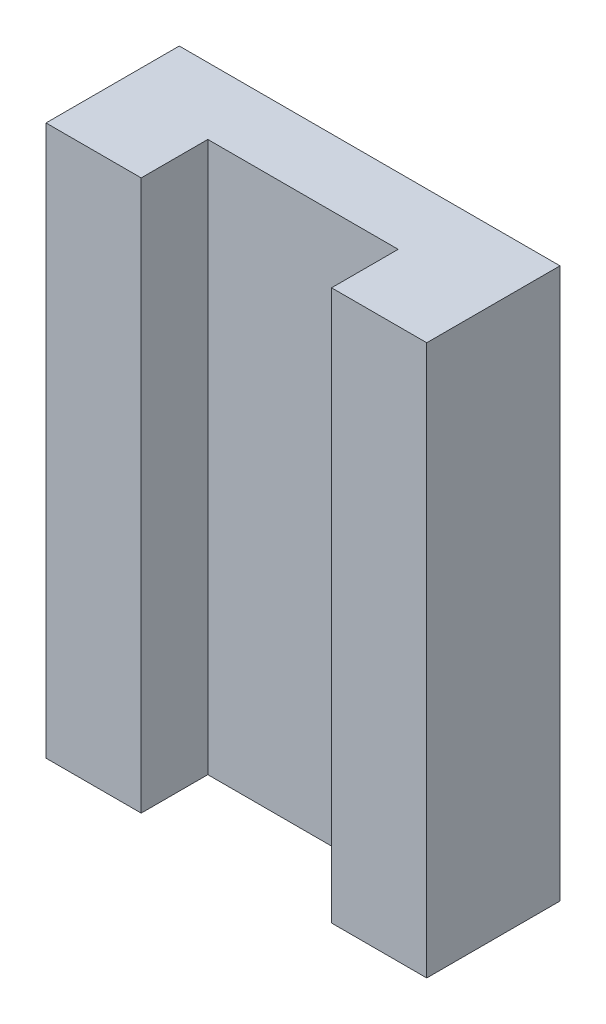
ISO-10303-21;
HEADER;
FILE_DESCRIPTION(('STEP AP214'),'2;1');
FILE_NAME('part.step','',(''),(''),'','','');
FILE_SCHEMA(('AUTOMOTIVE_DESIGN { 1 0 10303 214 1 1 1 1 }'));
ENDSEC;
DATA;
#1=APPLICATION_CONTEXT('core data for automotive mechanical design processes');
#2=APPLICATION_PROTOCOL_DEFINITION('international standard','automotive_design',2000,#1);
#3=PRODUCT_CONTEXT('',#1,'mechanical');
#4=PRODUCT('Part','Part','',(#3));
#5=PRODUCT_RELATED_PRODUCT_CATEGORY('part','',(#4));
#6=PRODUCT_DEFINITION_FORMATION('','',#4);
#7=PRODUCT_DEFINITION_CONTEXT('part definition',#1,'design');
#8=PRODUCT_DEFINITION('design','',#6,#7);
#9=PRODUCT_DEFINITION_SHAPE('','',#8);
#10=(LENGTH_UNIT() NAMED_UNIT(*) SI_UNIT(.MILLI.,.METRE.));
#11=(NAMED_UNIT(*) PLANE_ANGLE_UNIT() SI_UNIT($,.RADIAN.));
#12=(NAMED_UNIT(*) SI_UNIT($,.STERADIAN.) SOLID_ANGLE_UNIT());
#13=UNCERTAINTY_MEASURE_WITH_UNIT(LENGTH_MEASURE(1.E-05),#10,'distance_accuracy_value','');
#14=(GEOMETRIC_REPRESENTATION_CONTEXT(3) GLOBAL_UNCERTAINTY_ASSIGNED_CONTEXT((#13)) GLOBAL_UNIT_ASSIGNED_CONTEXT((#10,
#11,#12)) REPRESENTATION_CONTEXT('',''));
#15=CARTESIAN_POINT('',(0.,0.,0.));
#16=DIRECTION('',(0.,0.,1.));
#17=DIRECTION('',(1.,0.,0.));
#18=AXIS2_PLACEMENT_3D('',#15,#16,#17);
#19=CARTESIAN_POINT('',(0.,0.,7.));
#20=DIRECTION('',(0.,0.,-1.));
#21=DIRECTION('',(-1.,0.,0.));
#22=AXIS2_PLACEMENT_3D('',#19,#20,#21);
#23=PLANE('',#22);
#24=DIRECTION('',(1.,0.,0.));
#25=VECTOR('',#24,1.);
#26=CARTESIAN_POINT('',(-20.6864638809626,7.10354090893267,7.));
#27=LINE('',#26,#25);
#28=CARTESIAN_POINT('',(-40.6864638809626,7.10354090893267,7.));
#29=VERTEX_POINT('',#28);
#30=CARTESIAN_POINT('',(-35.6864638809626,7.10354090893267,7.));
#31=VERTEX_POINT('',#30);
#32=EDGE_CURVE('E88',#29,#31,#27,.T.);
#33=ORIENTED_EDGE('',*,*,#32,.T.);
#34=DIRECTION('',(0.,1.,0.));
#35=VECTOR('',#34,1.);
#36=CARTESIAN_POINT('',(-35.6864638809626,0.,7.));
#37=LINE('',#36,#35);
#38=CARTESIAN_POINT('',(-35.6864638809626,36.0035409089327,7.));
#39=VERTEX_POINT('',#38);
#40=EDGE_CURVE('E11',#31,#39,#37,.T.);
#41=ORIENTED_EDGE('',*,*,#40,.T.);
#42=DIRECTION('',(-1.,0.,0.));
#43=VECTOR('',#42,1.);
#44=CARTESIAN_POINT('',(-40.6864638809626,36.0035409089327,7.));
#45=LINE('',#44,#43);
#46=CARTESIAN_POINT('',(-40.6864638809626,36.0035409089327,7.));
#47=VERTEX_POINT('',#46);
#48=EDGE_CURVE('E58',#39,#47,#45,.T.);
#49=ORIENTED_EDGE('',*,*,#48,.T.);
#50=DIRECTION('',(0.,-1.,0.));
#51=VECTOR('',#50,1.);
#52=CARTESIAN_POINT('',(-40.6864638809626,7.10354090893267,7.));
#53=LINE('',#52,#51);
#54=EDGE_CURVE('E145',#47,#29,#53,.T.);
#55=ORIENTED_EDGE('',*,*,#54,.T.);
#56=EDGE_LOOP('',(#33,#41,#49,#55));
#57=FACE_BOUND('',#56,.T.);
#58=ADVANCED_FACE('F35',(#57),#23,.F.);
#59=CARTESIAN_POINT('',(-40.6864638809626,7.10354090893267,7.));
#60=DIRECTION('',(1.,0.,0.));
#61=DIRECTION('',(0.,0.,-1.));
#62=AXIS2_PLACEMENT_3D('',#59,#60,#61);
#63=PLANE('',#62);
#64=DIRECTION('',(0.,-1.,0.));
#65=VECTOR('',#64,1.);
#66=CARTESIAN_POINT('',(-40.6864638809626,7.10354090893267,0.));
#67=LINE('',#66,#65);
#68=CARTESIAN_POINT('',(-40.6864638809626,36.0035409089327,0.));
#69=VERTEX_POINT('',#68);
#70=CARTESIAN_POINT('',(-40.6864638809626,7.10354090893267,0.));
#71=VERTEX_POINT('',#70);
#72=EDGE_CURVE('E137',#69,#71,#67,.T.);
#73=ORIENTED_EDGE('',*,*,#72,.T.);
#74=DIRECTION('',(0.,0.,-1.));
#75=VECTOR('',#74,1.);
#76=CARTESIAN_POINT('',(-40.6864638809626,7.10354090893267,7.));
#77=LINE('',#76,#75);
#78=EDGE_CURVE('E117',#29,#71,#77,.T.);
#79=ORIENTED_EDGE('',*,*,#78,.F.);
#80=ORIENTED_EDGE('',*,*,#54,.F.);
#81=DIRECTION('',(0.,0.,-1.));
#82=VECTOR('',#81,1.);
#83=CARTESIAN_POINT('',(-40.6864638809626,36.0035409089327,7.));
#84=LINE('',#83,#82);
#85=EDGE_CURVE('E130',#47,#69,#84,.T.);
#86=ORIENTED_EDGE('',*,*,#85,.T.);
#87=EDGE_LOOP('',(#73,#79,#80,#86));
#88=FACE_BOUND('',#87,.T.);
#89=ADVANCED_FACE('F37',(#88),#63,.F.);
#90=CARTESIAN_POINT('',(-20.6864638809626,7.10354090893267,7.));
#91=DIRECTION('',(0.,1.,0.));
#92=DIRECTION('',(0.,0.,1.));
#93=AXIS2_PLACEMENT_3D('',#90,#91,#92);
#94=PLANE('',#93);
#95=DIRECTION('',(-1.,0.,0.));
#96=VECTOR('',#95,1.);
#97=CARTESIAN_POINT('',(-20.6864638809626,7.10354090893267,3.5));
#98=LINE('',#97,#96);
#99=CARTESIAN_POINT('',(-25.6864638809626,7.10354090893267,3.5));
#100=VERTEX_POINT('',#99);
#101=CARTESIAN_POINT('',(-35.6864638809626,7.10354090893267,3.5));
#102=VERTEX_POINT('',#101);
#103=EDGE_CURVE('E141',#100,#102,#98,.T.);
#104=ORIENTED_EDGE('',*,*,#103,.T.);
#105=DIRECTION('',(0.,0.,1.));
#106=VECTOR('',#105,1.);
#107=CARTESIAN_POINT('',(-35.6864638809626,7.10354090893267,7.));
#108=LINE('',#107,#106);
#109=EDGE_CURVE('E167',#102,#31,#108,.T.);
#110=ORIENTED_EDGE('',*,*,#109,.T.);
#111=ORIENTED_EDGE('',*,*,#32,.F.);
#112=ORIENTED_EDGE('',*,*,#78,.T.);
#113=DIRECTION('',(1.,0.,0.));
#114=VECTOR('',#113,1.);
#115=CARTESIAN_POINT('',(-20.6864638809626,7.10354090893267,0.));
#116=LINE('',#115,#114);
#117=CARTESIAN_POINT('',(-20.6864638809626,7.10354090893267,0.));
#118=VERTEX_POINT('',#117);
#119=EDGE_CURVE('E140',#71,#118,#116,.T.);
#120=ORIENTED_EDGE('',*,*,#119,.T.);
#121=DIRECTION('',(0.,0.,-1.));
#122=VECTOR('',#121,1.);
#123=CARTESIAN_POINT('',(-20.6864638809626,7.10354090893267,7.));
#124=LINE('',#123,#122);
#125=CARTESIAN_POINT('',(-20.6864638809626,7.10354090893267,7.));
#126=VERTEX_POINT('',#125);
#127=EDGE_CURVE('E148',#126,#118,#124,.T.);
#128=ORIENTED_EDGE('',*,*,#127,.F.);
#129=CARTESIAN_POINT('',(-25.6864638809626,7.10354090893267,7.));
#130=VERTEX_POINT('',#129);
#131=EDGE_CURVE('E163',#130,#126,#27,.T.);
#132=ORIENTED_EDGE('',*,*,#131,.F.);
#133=DIRECTION('',(0.,0.,-1.));
#134=VECTOR('',#133,1.);
#135=CARTESIAN_POINT('',(-25.6864638809626,7.10354090893267,7.));
#136=LINE('',#135,#134);
#137=EDGE_CURVE('E50',#130,#100,#136,.T.);
#138=ORIENTED_EDGE('',*,*,#137,.T.);
#139=EDGE_LOOP('',(#104,#110,#111,#112,#120,#128,#132,#138));
#140=FACE_BOUND('',#139,.T.);
#141=ADVANCED_FACE('F153',(#140),#94,.F.);
#142=CARTESIAN_POINT('',(-20.6864638809626,36.0035409089327,7.));
#143=DIRECTION('',(-1.,0.,0.));
#144=DIRECTION('',(0.,0.,1.));
#145=AXIS2_PLACEMENT_3D('',#142,#143,#144);
#146=PLANE('',#145);
#147=DIRECTION('',(0.,1.,0.));
#148=VECTOR('',#147,1.);
#149=CARTESIAN_POINT('',(-20.6864638809626,36.0035409089327,0.));
#150=LINE('',#149,#148);
#151=CARTESIAN_POINT('',(-20.6864638809626,36.0035409089327,0.));
#152=VERTEX_POINT('',#151);
#153=EDGE_CURVE('E143',#118,#152,#150,.T.);
#154=ORIENTED_EDGE('',*,*,#153,.T.);
#155=DIRECTION('',(0.,0.,-1.));
#156=VECTOR('',#155,1.);
#157=CARTESIAN_POINT('',(-20.6864638809626,36.0035409089327,7.));
#158=LINE('',#157,#156);
#159=CARTESIAN_POINT('',(-20.6864638809626,36.0035409089327,7.));
#160=VERTEX_POINT('',#159);
#161=EDGE_CURVE('E132',#160,#152,#158,.T.);
#162=ORIENTED_EDGE('',*,*,#161,.F.);
#163=DIRECTION('',(0.,1.,0.));
#164=VECTOR('',#163,1.);
#165=CARTESIAN_POINT('',(-20.6864638809626,36.0035409089327,7.));
#166=LINE('',#165,#164);
#167=EDGE_CURVE('E128',#126,#160,#166,.T.);
#168=ORIENTED_EDGE('',*,*,#167,.F.);
#169=ORIENTED_EDGE('',*,*,#127,.T.);
#170=EDGE_LOOP('',(#154,#162,#168,#169));
#171=FACE_BOUND('',#170,.T.);
#172=ADVANCED_FACE('F162',(#171),#146,.F.);
#173=CARTESIAN_POINT('',(-40.6864638809626,36.0035409089327,7.));
#174=DIRECTION('',(0.,-1.,0.));
#175=DIRECTION('',(0.,0.,-1.));
#176=AXIS2_PLACEMENT_3D('',#173,#174,#175);
#177=PLANE('',#176);
#178=ORIENTED_EDGE('',*,*,#48,.F.);
#179=DIRECTION('',(0.,0.,1.));
#180=VECTOR('',#179,1.);
#181=CARTESIAN_POINT('',(-35.6864638809626,36.0035409089327,7.));
#182=LINE('',#181,#180);
#183=CARTESIAN_POINT('',(-35.6864638809626,36.0035409089327,3.5));
#184=VERTEX_POINT('',#183);
#185=EDGE_CURVE('E173',#184,#39,#182,.T.);
#186=ORIENTED_EDGE('',*,*,#185,.F.);
#187=DIRECTION('',(-1.,0.,0.));
#188=VECTOR('',#187,1.);
#189=CARTESIAN_POINT('',(-35.6864638809626,36.0035409089327,3.5));
#190=LINE('',#189,#188);
#191=CARTESIAN_POINT('',(-25.6864638809626,36.0035409089327,3.5));
#192=VERTEX_POINT('',#191);
#193=EDGE_CURVE('E123',#192,#184,#190,.T.);
#194=ORIENTED_EDGE('',*,*,#193,.F.);
#195=DIRECTION('',(0.,0.,-1.));
#196=VECTOR('',#195,1.);
#197=CARTESIAN_POINT('',(-25.6864638809626,36.0035409089327,3.5));
#198=LINE('',#197,#196);
#199=CARTESIAN_POINT('',(-25.6864638809626,36.0035409089327,7.));
#200=VERTEX_POINT('',#199);
#201=EDGE_CURVE('E112',#200,#192,#198,.T.);
#202=ORIENTED_EDGE('',*,*,#201,.F.);
#203=EDGE_CURVE('E120',#160,#200,#45,.T.);
#204=ORIENTED_EDGE('',*,*,#203,.F.);
#205=ORIENTED_EDGE('',*,*,#161,.T.);
#206=DIRECTION('',(-1.,0.,0.));
#207=VECTOR('',#206,1.);
#208=CARTESIAN_POINT('',(-40.6864638809626,36.0035409089327,0.));
#209=LINE('',#208,#207);
#210=EDGE_CURVE('E80',#152,#69,#209,.T.);
#211=ORIENTED_EDGE('',*,*,#210,.T.);
#212=ORIENTED_EDGE('',*,*,#85,.F.);
#213=EDGE_LOOP('',(#178,#186,#194,#202,#204,#205,#211,#212));
#214=FACE_BOUND('',#213,.T.);
#215=ADVANCED_FACE('F119',(#214),#177,.F.);
#216=ORIENTED_EDGE('',*,*,#203,.T.);
#217=DIRECTION('',(0.,-1.,0.));
#218=VECTOR('',#217,1.);
#219=CARTESIAN_POINT('',(-25.6864638809626,0.,7.));
#220=LINE('',#219,#218);
#221=EDGE_CURVE('E43',#200,#130,#220,.T.);
#222=ORIENTED_EDGE('',*,*,#221,.T.);
#223=ORIENTED_EDGE('',*,*,#131,.T.);
#224=ORIENTED_EDGE('',*,*,#167,.T.);
#225=EDGE_LOOP('',(#216,#222,#223,#224));
#226=FACE_BOUND('',#225,.T.);
#227=ADVANCED_FACE('F126',(#226),#23,.F.);
#228=CARTESIAN_POINT('',(0.,0.,0.));
#229=DIRECTION('',(0.,0.,-1.));
#230=DIRECTION('',(-1.,0.,0.));
#231=AXIS2_PLACEMENT_3D('',#228,#229,#230);
#232=PLANE('',#231);
#233=CARTESIAN_POINT('',(-23.1864638809626,12.1035409089327,0.));
#234=DIRECTION('',(0.,0.,-1.));
#235=DIRECTION('',(1.,0.,0.));
#236=AXIS2_PLACEMENT_3D('',#233,#234,#235);
#237=CIRCLE('',#236,1.5);
#238=CARTESIAN_POINT('',(-21.6864638809626,12.1035409089327,0.));
#239=VERTEX_POINT('',#238);
#240=EDGE_CURVE('E183',#239,#239,#237,.T.);
#241=ORIENTED_EDGE('',*,*,#240,.F.);
#242=EDGE_LOOP('',(#241));
#243=FACE_BOUND('',#242,.T.);
#244=CARTESIAN_POINT('',(-38.1864638809626,12.1035409089327,0.));
#245=DIRECTION('',(0.,0.,-1.));
#246=DIRECTION('',(-1.,0.,0.));
#247=AXIS2_PLACEMENT_3D('',#244,#245,#246);
#248=CIRCLE('',#247,1.5);
#249=CARTESIAN_POINT('',(-39.6864638809626,12.1035409089327,0.));
#250=VERTEX_POINT('',#249);
#251=EDGE_CURVE('E189',#250,#250,#248,.T.);
#252=ORIENTED_EDGE('',*,*,#251,.F.);
#253=EDGE_LOOP('',(#252));
#254=FACE_BOUND('',#253,.T.);
#255=CARTESIAN_POINT('',(-38.1864638809626,31.0035409089327,0.));
#256=DIRECTION('',(0.,0.,-1.));
#257=DIRECTION('',(1.,0.,0.));
#258=AXIS2_PLACEMENT_3D('',#255,#256,#257);
#259=CIRCLE('',#258,1.5);
#260=CARTESIAN_POINT('',(-36.6864638809626,31.0035409089327,0.));
#261=VERTEX_POINT('',#260);
#262=EDGE_CURVE('E195',#261,#261,#259,.T.);
#263=ORIENTED_EDGE('',*,*,#262,.F.);
#264=EDGE_LOOP('',(#263));
#265=FACE_BOUND('',#264,.T.);
#266=CARTESIAN_POINT('',(-23.1864638809626,31.0035409089327,0.));
#267=DIRECTION('',(0.,0.,-1.));
#268=DIRECTION('',(-1.,0.,0.));
#269=AXIS2_PLACEMENT_3D('',#266,#267,#268);
#270=CIRCLE('',#269,1.5);
#271=CARTESIAN_POINT('',(-24.6864638809626,31.0035409089327,0.));
#272=VERTEX_POINT('',#271);
#273=EDGE_CURVE('E177',#272,#272,#270,.T.);
#274=ORIENTED_EDGE('',*,*,#273,.F.);
#275=EDGE_LOOP('',(#274));
#276=FACE_BOUND('',#275,.T.);
#277=ORIENTED_EDGE('',*,*,#72,.F.);
#278=ORIENTED_EDGE('',*,*,#210,.F.);
#279=ORIENTED_EDGE('',*,*,#153,.F.);
#280=ORIENTED_EDGE('',*,*,#119,.F.);
#281=EDGE_LOOP('',(#277,#278,#279,#280));
#282=FACE_BOUND('',#281,.T.);
#283=ADVANCED_FACE('F159',(#243,#254,#265,#276,#282),#232,.T.);
#284=CARTESIAN_POINT('',(-35.6864638809626,5.50354090893267,3.5));
#285=DIRECTION('',(0.,0.,-1.));
#286=DIRECTION('',(-1.,0.,0.));
#287=AXIS2_PLACEMENT_3D('',#284,#285,#286);
#288=PLANE('',#287);
#289=DIRECTION('',(0.,1.,0.));
#290=VECTOR('',#289,1.);
#291=CARTESIAN_POINT('',(-25.6864638809626,5.50354090893267,3.5));
#292=LINE('',#291,#290);
#293=EDGE_CURVE('E171',#100,#192,#292,.T.);
#294=ORIENTED_EDGE('',*,*,#293,.T.);
#295=ORIENTED_EDGE('',*,*,#193,.T.);
#296=DIRECTION('',(0.,1.,0.));
#297=VECTOR('',#296,1.);
#298=CARTESIAN_POINT('',(-35.6864638809626,5.50354090893267,3.5));
#299=LINE('',#298,#297);
#300=EDGE_CURVE('E170',#102,#184,#299,.T.);
#301=ORIENTED_EDGE('',*,*,#300,.F.);
#302=ORIENTED_EDGE('',*,*,#103,.F.);
#303=EDGE_LOOP('',(#294,#295,#301,#302));
#304=FACE_BOUND('',#303,.T.);
#305=ADVANCED_FACE('F212',(#304),#288,.F.);
#306=CARTESIAN_POINT('',(-35.6864638809626,5.50354090893267,7.));
#307=DIRECTION('',(-1.,0.,0.));
#308=DIRECTION('',(0.,0.,1.));
#309=AXIS2_PLACEMENT_3D('',#306,#307,#308);
#310=PLANE('',#309);
#311=ORIENTED_EDGE('',*,*,#300,.T.);
#312=ORIENTED_EDGE('',*,*,#185,.T.);
#313=ORIENTED_EDGE('',*,*,#40,.F.);
#314=ORIENTED_EDGE('',*,*,#109,.F.);
#315=EDGE_LOOP('',(#311,#312,#313,#314));
#316=FACE_BOUND('',#315,.T.);
#317=ADVANCED_FACE('F227',(#316),#310,.F.);
#318=CARTESIAN_POINT('',(-25.6864638809626,5.50354090893267,3.5));
#319=DIRECTION('',(1.,0.,0.));
#320=DIRECTION('',(0.,0.,-1.));
#321=AXIS2_PLACEMENT_3D('',#318,#319,#320);
#322=PLANE('',#321);
#323=ORIENTED_EDGE('',*,*,#221,.F.);
#324=ORIENTED_EDGE('',*,*,#201,.T.);
#325=ORIENTED_EDGE('',*,*,#293,.F.);
#326=ORIENTED_EDGE('',*,*,#137,.F.);
#327=EDGE_LOOP('',(#323,#324,#325,#326));
#328=FACE_BOUND('',#327,.T.);
#329=ADVANCED_FACE('F111',(#328),#322,.F.);
#330=CARTESIAN_POINT('',(-23.1864638809626,31.0035409089327,2.5));
#331=DIRECTION('',(0.,0.,-1.));
#332=DIRECTION('',(-1.,0.,0.));
#333=AXIS2_PLACEMENT_3D('',#330,#331,#332);
#334=CYLINDRICAL_SURFACE('',#333,1.5);
#335=CARTESIAN_POINT('',(-23.1864638809626,31.0035409089327,2.5));
#336=DIRECTION('',(0.,0.,-1.));
#337=DIRECTION('',(-1.,0.,0.));
#338=AXIS2_PLACEMENT_3D('',#335,#336,#337);
#339=CIRCLE('',#338,1.5);
#340=CARTESIAN_POINT('',(-24.6864638809626,31.0035409089327,2.5));
#341=VERTEX_POINT('',#340);
#342=EDGE_CURVE('E124',#341,#341,#339,.T.);
#343=ORIENTED_EDGE('',*,*,#342,.F.);
#344=EDGE_LOOP('',(#343));
#345=FACE_BOUND('',#344,.T.);
#346=ORIENTED_EDGE('',*,*,#273,.T.);
#347=EDGE_LOOP('',(#346));
#348=FACE_BOUND('',#347,.T.);
#349=ADVANCED_FACE('F217',(#345,#348),#334,.F.);
#350=CARTESIAN_POINT('',(-23.1864638809626,31.0035409089327,2.5));
#351=DIRECTION('',(0.,0.,-1.));
#352=DIRECTION('',(-1.,0.,0.));
#353=AXIS2_PLACEMENT_3D('',#350,#351,#352);
#354=PLANE('',#353);
#355=ORIENTED_EDGE('',*,*,#342,.T.);
#356=EDGE_LOOP('',(#355));
#357=FACE_BOUND('',#356,.T.);
#358=ADVANCED_FACE('F206',(#357),#354,.T.);
#359=CARTESIAN_POINT('',(-38.1864638809626,31.0035409089327,2.5));
#360=DIRECTION('',(0.,0.,-1.));
#361=DIRECTION('',(-1.,0.,0.));
#362=AXIS2_PLACEMENT_3D('',#359,#360,#361);
#363=CYLINDRICAL_SURFACE('',#362,1.5);
#364=CARTESIAN_POINT('',(-38.1864638809626,31.0035409089327,2.5));
#365=DIRECTION('',(0.,0.,-1.));
#366=DIRECTION('',(1.,0.,0.));
#367=AXIS2_PLACEMENT_3D('',#364,#365,#366);
#368=CIRCLE('',#367,1.5);
#369=CARTESIAN_POINT('',(-36.6864638809626,31.0035409089327,2.5));
#370=VERTEX_POINT('',#369);
#371=EDGE_CURVE('E180',#370,#370,#368,.T.);
#372=ORIENTED_EDGE('',*,*,#371,.F.);
#373=EDGE_LOOP('',(#372));
#374=FACE_BOUND('',#373,.T.);
#375=ORIENTED_EDGE('',*,*,#262,.T.);
#376=EDGE_LOOP('',(#375));
#377=FACE_BOUND('',#376,.T.);
#378=ADVANCED_FACE('F203',(#374,#377),#363,.F.);
#379=CARTESIAN_POINT('',(-38.1864638809626,31.0035409089327,2.5));
#380=DIRECTION('',(0.,0.,1.));
#381=DIRECTION('',(1.,0.,0.));
#382=AXIS2_PLACEMENT_3D('',#379,#380,#381);
#383=PLANE('',#382);
#384=ORIENTED_EDGE('',*,*,#371,.T.);
#385=EDGE_LOOP('',(#384));
#386=FACE_BOUND('',#385,.T.);
#387=ADVANCED_FACE('F201',(#386),#383,.F.);
#388=CARTESIAN_POINT('',(-38.1864638809626,12.1035409089327,2.5));
#389=DIRECTION('',(0.,0.,-1.));
#390=DIRECTION('',(-1.,0.,0.));
#391=AXIS2_PLACEMENT_3D('',#388,#389,#390);
#392=CYLINDRICAL_SURFACE('',#391,1.5);
#393=CARTESIAN_POINT('',(-38.1864638809626,12.1035409089327,2.5));
#394=DIRECTION('',(0.,0.,-1.));
#395=DIRECTION('',(-1.,0.,0.));
#396=AXIS2_PLACEMENT_3D('',#393,#394,#395);
#397=CIRCLE('',#396,1.5);
#398=CARTESIAN_POINT('',(-39.6864638809626,12.1035409089327,2.5));
#399=VERTEX_POINT('',#398);
#400=EDGE_CURVE('E192',#399,#399,#397,.T.);
#401=ORIENTED_EDGE('',*,*,#400,.F.);
#402=EDGE_LOOP('',(#401));
#403=FACE_BOUND('',#402,.T.);
#404=ORIENTED_EDGE('',*,*,#251,.T.);
#405=EDGE_LOOP('',(#404));
#406=FACE_BOUND('',#405,.T.);
#407=ADVANCED_FACE('F310',(#403,#406),#392,.F.);
#408=CARTESIAN_POINT('',(-38.1864638809626,12.1035409089327,2.5));
#409=DIRECTION('',(0.,0.,-1.));
#410=DIRECTION('',(-1.,0.,0.));
#411=AXIS2_PLACEMENT_3D('',#408,#409,#410);
#412=PLANE('',#411);
#413=ORIENTED_EDGE('',*,*,#400,.T.);
#414=EDGE_LOOP('',(#413));
#415=FACE_BOUND('',#414,.T.);
#416=ADVANCED_FACE('F318',(#415),#412,.T.);
#417=CARTESIAN_POINT('',(-23.1864638809626,12.1035409089327,2.5));
#418=DIRECTION('',(0.,0.,-1.));
#419=DIRECTION('',(-1.,0.,0.));
#420=AXIS2_PLACEMENT_3D('',#417,#418,#419);
#421=CYLINDRICAL_SURFACE('',#420,1.5);
#422=CARTESIAN_POINT('',(-23.1864638809626,12.1035409089327,2.5));
#423=DIRECTION('',(0.,0.,-1.));
#424=DIRECTION('',(1.,0.,0.));
#425=AXIS2_PLACEMENT_3D('',#422,#423,#424);
#426=CIRCLE('',#425,1.5);
#427=CARTESIAN_POINT('',(-21.6864638809626,12.1035409089327,2.5));
#428=VERTEX_POINT('',#427);
#429=EDGE_CURVE('E186',#428,#428,#426,.T.);
#430=ORIENTED_EDGE('',*,*,#429,.F.);
#431=EDGE_LOOP('',(#430));
#432=FACE_BOUND('',#431,.T.);
#433=ORIENTED_EDGE('',*,*,#240,.T.);
#434=EDGE_LOOP('',(#433));
#435=FACE_BOUND('',#434,.T.);
#436=ADVANCED_FACE('F327',(#432,#435),#421,.F.);
#437=CARTESIAN_POINT('',(-23.1864638809626,12.1035409089327,2.5));
#438=DIRECTION('',(0.,0.,1.));
#439=DIRECTION('',(1.,0.,0.));
#440=AXIS2_PLACEMENT_3D('',#437,#438,#439);
#441=PLANE('',#440);
#442=ORIENTED_EDGE('',*,*,#429,.T.);
#443=EDGE_LOOP('',(#442));
#444=FACE_BOUND('',#443,.T.);
#445=ADVANCED_FACE('F336',(#444),#441,.F.);
#446=CLOSED_SHELL('',(#58,#89,#141,#172,#215,#227,#283,#305,#317,#329,#349,#358,#378,#387,#407,
#416,#436,#445));
#447=MANIFOLD_SOLID_BREP('B2',#446);
#448=ADVANCED_BREP_SHAPE_REPRESENTATION('',(#18,#447),#14);
#449=SHAPE_DEFINITION_REPRESENTATION(#9,#448);
ENDSEC;
END-ISO-10303-21;
